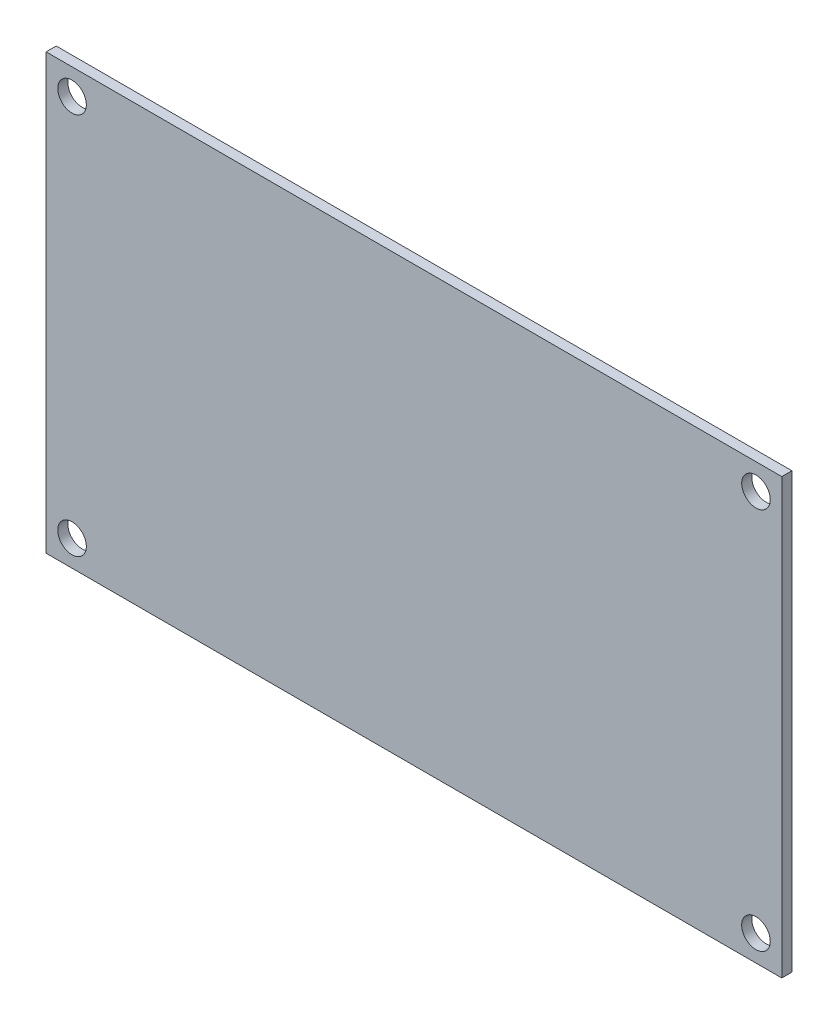
ISO-10303-21;
HEADER;
FILE_DESCRIPTION(('STEP AP214'),'2;1');
FILE_NAME('part.step','',(''),(''),'','','');
FILE_SCHEMA(('AUTOMOTIVE_DESIGN { 1 0 10303 214 1 1 1 1 }'));
ENDSEC;
DATA;
#1=APPLICATION_CONTEXT('core data for automotive mechanical design processes');
#2=APPLICATION_PROTOCOL_DEFINITION('international standard','automotive_design',2000,#1);
#3=PRODUCT_CONTEXT('',#1,'mechanical');
#4=PRODUCT('Part','Part','',(#3));
#5=PRODUCT_RELATED_PRODUCT_CATEGORY('part','',(#4));
#6=PRODUCT_DEFINITION_FORMATION('','',#4);
#7=PRODUCT_DEFINITION_CONTEXT('part definition',#1,'design');
#8=PRODUCT_DEFINITION('design','',#6,#7);
#9=PRODUCT_DEFINITION_SHAPE('','',#8);
#10=(LENGTH_UNIT() NAMED_UNIT(*) SI_UNIT(.MILLI.,.METRE.));
#11=(NAMED_UNIT(*) PLANE_ANGLE_UNIT() SI_UNIT($,.RADIAN.));
#12=(NAMED_UNIT(*) SI_UNIT($,.STERADIAN.) SOLID_ANGLE_UNIT());
#13=UNCERTAINTY_MEASURE_WITH_UNIT(LENGTH_MEASURE(1.E-05),#10,'distance_accuracy_value','');
#14=(GEOMETRIC_REPRESENTATION_CONTEXT(3) GLOBAL_UNCERTAINTY_ASSIGNED_CONTEXT((#13)) GLOBAL_UNIT_ASSIGNED_CONTEXT((#10,
#11,#12)) REPRESENTATION_CONTEXT('',''));
#15=CARTESIAN_POINT('',(0.,0.,0.));
#16=DIRECTION('',(0.,0.,1.));
#17=DIRECTION('',(1.,0.,0.));
#18=AXIS2_PLACEMENT_3D('',#15,#16,#17);
#19=CARTESIAN_POINT('',(0.,42.535,-0.9906));
#20=DIRECTION('',(0.,0.,-1.));
#21=DIRECTION('',(-1.,0.,0.));
#22=AXIS2_PLACEMENT_3D('',#19,#20,#21);
#23=PLANE('',#22);
#24=CARTESIAN_POINT('',(2.54,2.54,-0.9906));
#25=DIRECTION('',(0.,0.,1.));
#26=DIRECTION('',(1.,0.,0.));
#27=AXIS2_PLACEMENT_3D('',#24,#25,#26);
#28=CIRCLE('',#27,1.4);
#29=CARTESIAN_POINT('',(3.94,2.54,-0.9906));
#30=VERTEX_POINT('',#29);
#31=EDGE_CURVE('E92',#30,#30,#28,.T.);
#32=ORIENTED_EDGE('',*,*,#31,.T.);
#33=EDGE_LOOP('',(#32));
#34=FACE_BOUND('',#33,.T.);
#35=CARTESIAN_POINT('',(69.5325,2.54,-0.9906));
#36=DIRECTION('',(0.,0.,1.));
#37=DIRECTION('',(1.,0.,0.));
#38=AXIS2_PLACEMENT_3D('',#35,#36,#37);
#39=CIRCLE('',#38,1.4);
#40=CARTESIAN_POINT('',(70.9325,2.54,-0.9906));
#41=VERTEX_POINT('',#40);
#42=EDGE_CURVE('E95',#41,#41,#39,.T.);
#43=ORIENTED_EDGE('',*,*,#42,.T.);
#44=EDGE_LOOP('',(#43));
#45=FACE_BOUND('',#44,.T.);
#46=CARTESIAN_POINT('',(69.5325,40.005,-0.9906));
#47=DIRECTION('',(0.,0.,1.));
#48=DIRECTION('',(1.,0.,0.));
#49=AXIS2_PLACEMENT_3D('',#46,#47,#48);
#50=CIRCLE('',#49,1.4);
#51=CARTESIAN_POINT('',(70.9325,40.005,-0.9906));
#52=VERTEX_POINT('',#51);
#53=EDGE_CURVE('E97',#52,#52,#50,.T.);
#54=ORIENTED_EDGE('',*,*,#53,.T.);
#55=EDGE_LOOP('',(#54));
#56=FACE_BOUND('',#55,.T.);
#57=CARTESIAN_POINT('',(2.54,40.005,-0.9906));
#58=DIRECTION('',(0.,0.,1.));
#59=DIRECTION('',(1.,0.,0.));
#60=AXIS2_PLACEMENT_3D('',#57,#58,#59);
#61=CIRCLE('',#60,1.4);
#62=CARTESIAN_POINT('',(3.94,40.005,-0.9906));
#63=VERTEX_POINT('',#62);
#64=EDGE_CURVE('E20',#63,#63,#61,.T.);
#65=ORIENTED_EDGE('',*,*,#64,.T.);
#66=EDGE_LOOP('',(#65));
#67=FACE_BOUND('',#66,.T.);
#68=DIRECTION('',(1.,0.,0.));
#69=VECTOR('',#68,1.);
#70=CARTESIAN_POINT('',(0.,0.,-0.9906));
#71=LINE('',#70,#69);
#72=CARTESIAN_POINT('',(0.,0.,-0.9906));
#73=VERTEX_POINT('',#72);
#74=CARTESIAN_POINT('',(72.06,0.,-0.9906));
#75=VERTEX_POINT('',#74);
#76=EDGE_CURVE('E54',#73,#75,#71,.T.);
#77=ORIENTED_EDGE('',*,*,#76,.F.);
#78=DIRECTION('',(0.,1.,0.));
#79=VECTOR('',#78,1.);
#80=CARTESIAN_POINT('',(0.,42.535,-0.9906));
#81=LINE('',#80,#79);
#82=CARTESIAN_POINT('',(0.,42.535,-0.9906));
#83=VERTEX_POINT('',#82);
#84=EDGE_CURVE('E71',#83,#73,#81,.F.);
#85=ORIENTED_EDGE('',*,*,#84,.F.);
#86=DIRECTION('',(1.,0.,0.));
#87=VECTOR('',#86,1.);
#88=CARTESIAN_POINT('',(72.06,42.535,-0.9906));
#89=LINE('',#88,#87);
#90=CARTESIAN_POINT('',(72.06,42.535,-0.9906));
#91=VERTEX_POINT('',#90);
#92=EDGE_CURVE('E68',#91,#83,#89,.F.);
#93=ORIENTED_EDGE('',*,*,#92,.F.);
#94=DIRECTION('',(0.,1.,0.));
#95=VECTOR('',#94,1.);
#96=CARTESIAN_POINT('',(72.06,0.,-0.9906));
#97=LINE('',#96,#95);
#98=EDGE_CURVE('E59',#75,#91,#97,.T.);
#99=ORIENTED_EDGE('',*,*,#98,.F.);
#100=EDGE_LOOP('',(#77,#85,#93,#99));
#101=FACE_BOUND('',#100,.T.);
#102=ADVANCED_FACE('F17',(#34,#45,#56,#67,#101),#23,.T.);
#103=CARTESIAN_POINT('',(72.06,42.535,0.));
#104=DIRECTION('',(0.,1.,0.));
#105=DIRECTION('',(0.,0.,1.));
#106=AXIS2_PLACEMENT_3D('',#103,#104,#105);
#107=PLANE('',#106);
#108=DIRECTION('',(0.,0.,1.));
#109=VECTOR('',#108,1.);
#110=CARTESIAN_POINT('',(0.,42.535,0.));
#111=LINE('',#110,#109);
#112=CARTESIAN_POINT('',(0.,42.535,0.));
#113=VERTEX_POINT('',#112);
#114=EDGE_CURVE('E105',#113,#83,#111,.F.);
#115=ORIENTED_EDGE('',*,*,#114,.F.);
#116=DIRECTION('',(-1.,0.,0.));
#117=VECTOR('',#116,1.);
#118=CARTESIAN_POINT('',(0.,42.535,0.));
#119=LINE('',#118,#117);
#120=CARTESIAN_POINT('',(72.06,42.535,0.));
#121=VERTEX_POINT('',#120);
#122=EDGE_CURVE('E78',#113,#121,#119,.F.);
#123=ORIENTED_EDGE('',*,*,#122,.T.);
#124=DIRECTION('',(0.,0.,-1.));
#125=VECTOR('',#124,1.);
#126=CARTESIAN_POINT('',(72.06,42.535,0.));
#127=LINE('',#126,#125);
#128=EDGE_CURVE('E64',#91,#121,#127,.F.);
#129=ORIENTED_EDGE('',*,*,#128,.F.);
#130=ORIENTED_EDGE('',*,*,#92,.T.);
#131=EDGE_LOOP('',(#115,#123,#129,#130));
#132=FACE_BOUND('',#131,.T.);
#133=ADVANCED_FACE('F77',(#132),#107,.T.);
#134=CARTESIAN_POINT('',(72.06,0.,0.));
#135=DIRECTION('',(1.,0.,0.));
#136=DIRECTION('',(0.,0.,-1.));
#137=AXIS2_PLACEMENT_3D('',#134,#135,#136);
#138=PLANE('',#137);
#139=ORIENTED_EDGE('',*,*,#128,.T.);
#140=DIRECTION('',(0.,1.,0.));
#141=VECTOR('',#140,1.);
#142=CARTESIAN_POINT('',(72.06,42.535,0.));
#143=LINE('',#142,#141);
#144=CARTESIAN_POINT('',(72.06,0.,0.));
#145=VERTEX_POINT('',#144);
#146=EDGE_CURVE('E116',#121,#145,#143,.F.);
#147=ORIENTED_EDGE('',*,*,#146,.T.);
#148=DIRECTION('',(0.,0.,-1.));
#149=VECTOR('',#148,1.);
#150=CARTESIAN_POINT('',(72.06,0.,0.));
#151=LINE('',#150,#149);
#152=EDGE_CURVE('E66',#75,#145,#151,.F.);
#153=ORIENTED_EDGE('',*,*,#152,.F.);
#154=ORIENTED_EDGE('',*,*,#98,.T.);
#155=EDGE_LOOP('',(#139,#147,#153,#154));
#156=FACE_BOUND('',#155,.T.);
#157=ADVANCED_FACE('F61',(#156),#138,.T.);
#158=CARTESIAN_POINT('',(0.,0.,0.));
#159=DIRECTION('',(0.,-1.,0.));
#160=DIRECTION('',(0.,0.,-1.));
#161=AXIS2_PLACEMENT_3D('',#158,#159,#160);
#162=PLANE('',#161);
#163=ORIENTED_EDGE('',*,*,#152,.T.);
#164=DIRECTION('',(-1.,0.,0.));
#165=VECTOR('',#164,1.);
#166=CARTESIAN_POINT('',(0.,0.,0.));
#167=LINE('',#166,#165);
#168=CARTESIAN_POINT('',(0.,0.,0.));
#169=VERTEX_POINT('',#168);
#170=EDGE_CURVE('E113',#145,#169,#167,.T.);
#171=ORIENTED_EDGE('',*,*,#170,.T.);
#172=DIRECTION('',(0.,0.,1.));
#173=VECTOR('',#172,1.);
#174=CARTESIAN_POINT('',(0.,0.,0.));
#175=LINE('',#174,#173);
#176=EDGE_CURVE('E35',#73,#169,#175,.T.);
#177=ORIENTED_EDGE('',*,*,#176,.F.);
#178=ORIENTED_EDGE('',*,*,#76,.T.);
#179=EDGE_LOOP('',(#163,#171,#177,#178));
#180=FACE_BOUND('',#179,.T.);
#181=ADVANCED_FACE('F112',(#180),#162,.T.);
#182=CARTESIAN_POINT('',(0.,42.535,0.));
#183=DIRECTION('',(-1.,0.,0.));
#184=DIRECTION('',(0.,0.,1.));
#185=AXIS2_PLACEMENT_3D('',#182,#183,#184);
#186=PLANE('',#185);
#187=ORIENTED_EDGE('',*,*,#176,.T.);
#188=DIRECTION('',(0.,1.,0.));
#189=VECTOR('',#188,1.);
#190=CARTESIAN_POINT('',(0.,42.535,0.));
#191=LINE('',#190,#189);
#192=EDGE_CURVE('E91',#169,#113,#191,.T.);
#193=ORIENTED_EDGE('',*,*,#192,.T.);
#194=ORIENTED_EDGE('',*,*,#114,.T.);
#195=ORIENTED_EDGE('',*,*,#84,.T.);
#196=EDGE_LOOP('',(#187,#193,#194,#195));
#197=FACE_BOUND('',#196,.T.);
#198=ADVANCED_FACE('F119',(#197),#186,.T.);
#199=CARTESIAN_POINT('',(2.54,40.005,0.));
#200=DIRECTION('',(0.,0.,1.));
#201=DIRECTION('',(1.,0.,0.));
#202=AXIS2_PLACEMENT_3D('',#199,#200,#201);
#203=CYLINDRICAL_SURFACE('',#202,1.4);
#204=ORIENTED_EDGE('',*,*,#64,.F.);
#205=EDGE_LOOP('',(#204));
#206=FACE_BOUND('',#205,.T.);
#207=CARTESIAN_POINT('',(2.54,40.005,0.));
#208=DIRECTION('',(0.,0.,1.));
#209=DIRECTION('',(1.,0.,0.));
#210=AXIS2_PLACEMENT_3D('',#207,#208,#209);
#211=CIRCLE('',#210,1.4);
#212=CARTESIAN_POINT('',(3.94,40.005,0.));
#213=VERTEX_POINT('',#212);
#214=EDGE_CURVE('E88',#213,#213,#211,.T.);
#215=ORIENTED_EDGE('',*,*,#214,.T.);
#216=EDGE_LOOP('',(#215));
#217=FACE_BOUND('',#216,.T.);
#218=ADVANCED_FACE('F121',(#206,#217),#203,.F.);
#219=CARTESIAN_POINT('',(69.5325,40.005,0.));
#220=DIRECTION('',(0.,0.,1.));
#221=DIRECTION('',(1.,0.,0.));
#222=AXIS2_PLACEMENT_3D('',#219,#220,#221);
#223=CYLINDRICAL_SURFACE('',#222,1.4);
#224=ORIENTED_EDGE('',*,*,#53,.F.);
#225=EDGE_LOOP('',(#224));
#226=FACE_BOUND('',#225,.T.);
#227=CARTESIAN_POINT('',(69.5325,40.005,0.));
#228=DIRECTION('',(0.,0.,1.));
#229=DIRECTION('',(1.,0.,0.));
#230=AXIS2_PLACEMENT_3D('',#227,#228,#229);
#231=CIRCLE('',#230,1.4);
#232=CARTESIAN_POINT('',(70.9325,40.005,0.));
#233=VERTEX_POINT('',#232);
#234=EDGE_CURVE('E85',#233,#233,#231,.T.);
#235=ORIENTED_EDGE('',*,*,#234,.T.);
#236=EDGE_LOOP('',(#235));
#237=FACE_BOUND('',#236,.T.);
#238=ADVANCED_FACE('F128',(#226,#237),#223,.F.);
#239=CARTESIAN_POINT('',(69.5325,2.54,0.));
#240=DIRECTION('',(0.,0.,1.));
#241=DIRECTION('',(1.,0.,0.));
#242=AXIS2_PLACEMENT_3D('',#239,#240,#241);
#243=CYLINDRICAL_SURFACE('',#242,1.4);
#244=ORIENTED_EDGE('',*,*,#42,.F.);
#245=EDGE_LOOP('',(#244));
#246=FACE_BOUND('',#245,.T.);
#247=CARTESIAN_POINT('',(69.5325,2.54,0.));
#248=DIRECTION('',(0.,0.,1.));
#249=DIRECTION('',(1.,0.,0.));
#250=AXIS2_PLACEMENT_3D('',#247,#248,#249);
#251=CIRCLE('',#250,1.4);
#252=CARTESIAN_POINT('',(70.9325,2.54,0.));
#253=VERTEX_POINT('',#252);
#254=EDGE_CURVE('E26',#253,#253,#251,.T.);
#255=ORIENTED_EDGE('',*,*,#254,.T.);
#256=EDGE_LOOP('',(#255));
#257=FACE_BOUND('',#256,.T.);
#258=ADVANCED_FACE('F139',(#246,#257),#243,.F.);
#259=CARTESIAN_POINT('',(2.54,2.54,0.));
#260=DIRECTION('',(0.,0.,1.));
#261=DIRECTION('',(1.,0.,0.));
#262=AXIS2_PLACEMENT_3D('',#259,#260,#261);
#263=CYLINDRICAL_SURFACE('',#262,1.4);
#264=ORIENTED_EDGE('',*,*,#31,.F.);
#265=EDGE_LOOP('',(#264));
#266=FACE_BOUND('',#265,.T.);
#267=CARTESIAN_POINT('',(2.54,2.54,0.));
#268=DIRECTION('',(0.,0.,1.));
#269=DIRECTION('',(1.,0.,0.));
#270=AXIS2_PLACEMENT_3D('',#267,#268,#269);
#271=CIRCLE('',#270,1.4);
#272=CARTESIAN_POINT('',(3.94,2.54,0.));
#273=VERTEX_POINT('',#272);
#274=EDGE_CURVE('E11',#273,#273,#271,.T.);
#275=ORIENTED_EDGE('',*,*,#274,.T.);
#276=EDGE_LOOP('',(#275));
#277=FACE_BOUND('',#276,.T.);
#278=ADVANCED_FACE('F133',(#266,#277),#263,.F.);
#279=CARTESIAN_POINT('',(0.,42.535,0.));
#280=DIRECTION('',(0.,0.,-1.));
#281=DIRECTION('',(-1.,0.,0.));
#282=AXIS2_PLACEMENT_3D('',#279,#280,#281);
#283=PLANE('',#282);
#284=ORIENTED_EDGE('',*,*,#274,.F.);
#285=EDGE_LOOP('',(#284));
#286=FACE_BOUND('',#285,.T.);
#287=ORIENTED_EDGE('',*,*,#254,.F.);
#288=EDGE_LOOP('',(#287));
#289=FACE_BOUND('',#288,.T.);
#290=ORIENTED_EDGE('',*,*,#234,.F.);
#291=EDGE_LOOP('',(#290));
#292=FACE_BOUND('',#291,.T.);
#293=ORIENTED_EDGE('',*,*,#214,.F.);
#294=EDGE_LOOP('',(#293));
#295=FACE_BOUND('',#294,.T.);
#296=ORIENTED_EDGE('',*,*,#170,.F.);
#297=ORIENTED_EDGE('',*,*,#146,.F.);
#298=ORIENTED_EDGE('',*,*,#122,.F.);
#299=ORIENTED_EDGE('',*,*,#192,.F.);
#300=EDGE_LOOP('',(#296,#297,#298,#299));
#301=FACE_BOUND('',#300,.T.);
#302=ADVANCED_FACE('F115',(#286,#289,#292,#295,#301),#283,.F.);
#303=CLOSED_SHELL('',(#102,#133,#157,#181,#198,#218,#238,#258,#278,#302));
#304=MANIFOLD_SOLID_BREP('B1',#303);
#305=ADVANCED_BREP_SHAPE_REPRESENTATION('',(#18,#304),#14);
#306=SHAPE_DEFINITION_REPRESENTATION(#9,#305);
ENDSEC;
END-ISO-10303-21;
